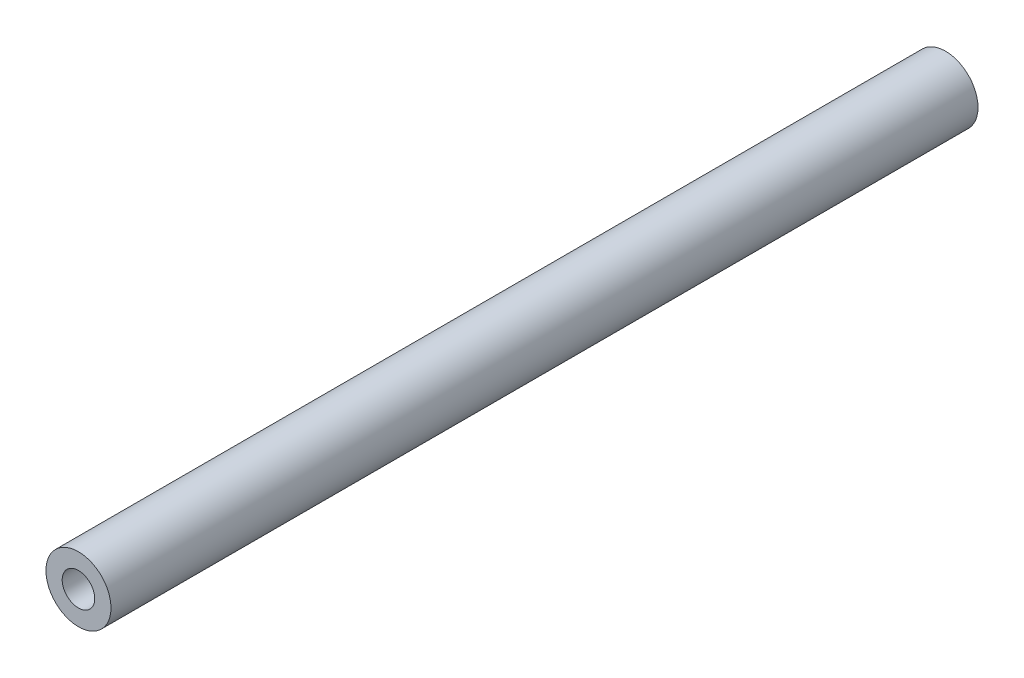
ISO-10303-21;
HEADER;
FILE_DESCRIPTION(('STEP AP214'),'2;1');
FILE_NAME('part.step','',(''),(''),'','','');
FILE_SCHEMA(('AUTOMOTIVE_DESIGN { 1 0 10303 214 1 1 1 1 }'));
ENDSEC;
DATA;
#1=APPLICATION_CONTEXT('core data for automotive mechanical design processes');
#2=APPLICATION_PROTOCOL_DEFINITION('international standard','automotive_design',2000,#1);
#3=PRODUCT_CONTEXT('',#1,'mechanical');
#4=PRODUCT('Part','Part','',(#3));
#5=PRODUCT_RELATED_PRODUCT_CATEGORY('part','',(#4));
#6=PRODUCT_DEFINITION_FORMATION('','',#4);
#7=PRODUCT_DEFINITION_CONTEXT('part definition',#1,'design');
#8=PRODUCT_DEFINITION('design','',#6,#7);
#9=PRODUCT_DEFINITION_SHAPE('','',#8);
#10=(LENGTH_UNIT() NAMED_UNIT(*) SI_UNIT(.MILLI.,.METRE.));
#11=(NAMED_UNIT(*) PLANE_ANGLE_UNIT() SI_UNIT($,.RADIAN.));
#12=(NAMED_UNIT(*) SI_UNIT($,.STERADIAN.) SOLID_ANGLE_UNIT());
#13=UNCERTAINTY_MEASURE_WITH_UNIT(LENGTH_MEASURE(1.E-05),#10,'distance_accuracy_value','');
#14=(GEOMETRIC_REPRESENTATION_CONTEXT(3) GLOBAL_UNCERTAINTY_ASSIGNED_CONTEXT((#13)) GLOBAL_UNIT_ASSIGNED_CONTEXT((#10,
#11,#12)) REPRESENTATION_CONTEXT('',''));
#15=CARTESIAN_POINT('',(0.,0.,0.));
#16=DIRECTION('',(0.,0.,1.));
#17=DIRECTION('',(1.,0.,0.));
#18=AXIS2_PLACEMENT_3D('',#15,#16,#17);
#19=CARTESIAN_POINT('',(0.,0.,80.));
#20=DIRECTION('',(0.,0.,1.));
#21=DIRECTION('',(1.,0.,0.));
#22=AXIS2_PLACEMENT_3D('',#19,#20,#21);
#23=PLANE('',#22);
#24=CARTESIAN_POINT('',(0.,0.,80.));
#25=DIRECTION('',(0.,0.,1.));
#26=DIRECTION('',(1.,0.,0.));
#27=AXIS2_PLACEMENT_3D('',#24,#25,#26);
#28=CIRCLE('',#27,3.);
#29=CARTESIAN_POINT('',(3.,0.,80.));
#30=VERTEX_POINT('',#29);
#31=EDGE_CURVE('E10',#30,#30,#28,.T.);
#32=ORIENTED_EDGE('',*,*,#31,.T.);
#33=EDGE_LOOP('',(#32));
#34=FACE_BOUND('',#33,.T.);
#35=CARTESIAN_POINT('',(0.,0.,80.));
#36=DIRECTION('',(0.,0.,1.));
#37=DIRECTION('',(1.,0.,0.));
#38=AXIS2_PLACEMENT_3D('',#35,#36,#37);
#39=CIRCLE('',#38,1.5);
#40=CARTESIAN_POINT('',(1.5,0.,80.));
#41=VERTEX_POINT('',#40);
#42=EDGE_CURVE('E50',#41,#41,#39,.T.);
#43=ORIENTED_EDGE('',*,*,#42,.F.);
#44=EDGE_LOOP('',(#43));
#45=FACE_BOUND('',#44,.T.);
#46=ADVANCED_FACE('F37',(#34,#45),#23,.T.);
#47=CARTESIAN_POINT('',(0.,0.,0.));
#48=DIRECTION('',(0.,0.,1.));
#49=DIRECTION('',(1.,0.,0.));
#50=AXIS2_PLACEMENT_3D('',#47,#48,#49);
#51=PLANE('',#50);
#52=CARTESIAN_POINT('',(0.,0.,0.));
#53=DIRECTION('',(0.,0.,1.));
#54=DIRECTION('',(1.,0.,0.));
#55=AXIS2_PLACEMENT_3D('',#52,#53,#54);
#56=CIRCLE('',#55,3.);
#57=CARTESIAN_POINT('',(3.,0.,0.));
#58=VERTEX_POINT('',#57);
#59=EDGE_CURVE('E41',#58,#58,#56,.T.);
#60=ORIENTED_EDGE('',*,*,#59,.F.);
#61=EDGE_LOOP('',(#60));
#62=FACE_BOUND('',#61,.T.);
#63=CARTESIAN_POINT('',(0.,0.,0.));
#64=DIRECTION('',(0.,0.,1.));
#65=DIRECTION('',(1.,0.,0.));
#66=AXIS2_PLACEMENT_3D('',#63,#64,#65);
#67=CIRCLE('',#66,1.5);
#68=CARTESIAN_POINT('',(1.5,0.,0.));
#69=VERTEX_POINT('',#68);
#70=EDGE_CURVE('E52',#69,#69,#67,.T.);
#71=ORIENTED_EDGE('',*,*,#70,.T.);
#72=EDGE_LOOP('',(#71));
#73=FACE_BOUND('',#72,.T.);
#74=ADVANCED_FACE('F64',(#62,#73),#51,.F.);
#75=CARTESIAN_POINT('',(0.,0.,80.));
#76=DIRECTION('',(0.,0.,-1.));
#77=DIRECTION('',(-1.,0.,0.));
#78=AXIS2_PLACEMENT_3D('',#75,#76,#77);
#79=CYLINDRICAL_SURFACE('',#78,3.);
#80=ORIENTED_EDGE('',*,*,#31,.F.);
#81=EDGE_LOOP('',(#80));
#82=FACE_BOUND('',#81,.T.);
#83=ORIENTED_EDGE('',*,*,#59,.T.);
#84=EDGE_LOOP('',(#83));
#85=FACE_BOUND('',#84,.T.);
#86=ADVANCED_FACE('F39',(#82,#85),#79,.T.);
#87=CARTESIAN_POINT('',(0.,0.,80.));
#88=DIRECTION('',(0.,0.,-1.));
#89=DIRECTION('',(-1.,0.,0.));
#90=AXIS2_PLACEMENT_3D('',#87,#88,#89);
#91=CYLINDRICAL_SURFACE('',#90,1.5);
#92=ORIENTED_EDGE('',*,*,#42,.T.);
#93=EDGE_LOOP('',(#92));
#94=FACE_BOUND('',#93,.T.);
#95=ORIENTED_EDGE('',*,*,#70,.F.);
#96=EDGE_LOOP('',(#95));
#97=FACE_BOUND('',#96,.T.);
#98=ADVANCED_FACE('F60',(#94,#97),#91,.F.);
#99=CLOSED_SHELL('',(#46,#74,#86,#98));
#100=MANIFOLD_SOLID_BREP('B2',#99);
#101=ADVANCED_BREP_SHAPE_REPRESENTATION('',(#18,#100),#14);
#102=SHAPE_DEFINITION_REPRESENTATION(#9,#101);
ENDSEC;
END-ISO-10303-21;
